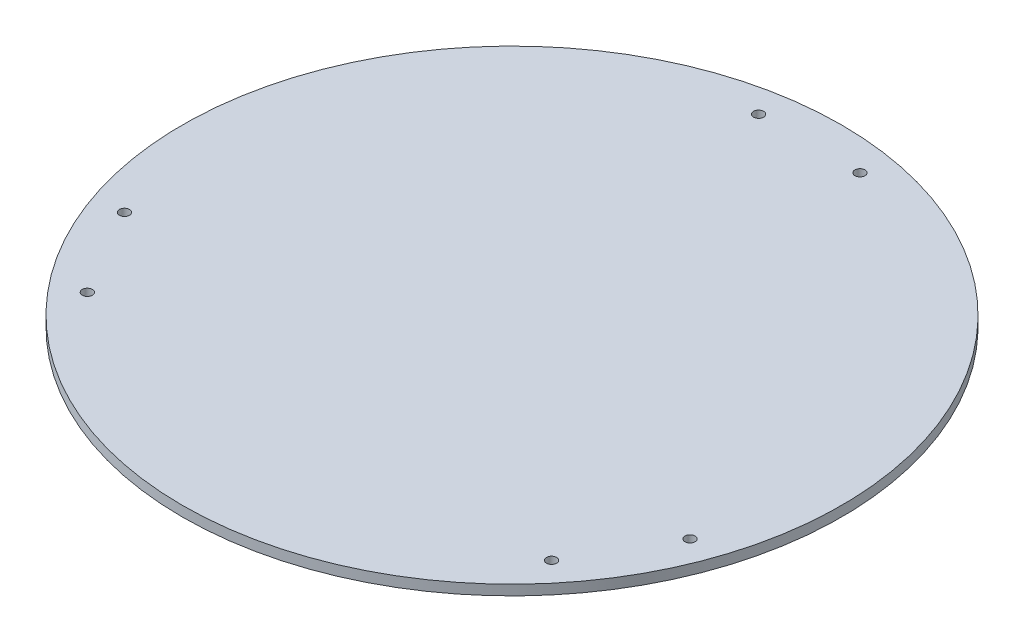
ISO-10303-21;
HEADER;
FILE_DESCRIPTION(('STEP AP214'),'2;1');
FILE_NAME('part.step','',(''),(''),'','','');
FILE_SCHEMA(('AUTOMOTIVE_DESIGN { 1 0 10303 214 1 1 1 1 }'));
ENDSEC;
DATA;
#1=APPLICATION_CONTEXT('core data for automotive mechanical design processes');
#2=APPLICATION_PROTOCOL_DEFINITION('international standard','automotive_design',2000,#1);
#3=PRODUCT_CONTEXT('',#1,'mechanical');
#4=PRODUCT('Part','Part','',(#3));
#5=PRODUCT_RELATED_PRODUCT_CATEGORY('part','',(#4));
#6=PRODUCT_DEFINITION_FORMATION('','',#4);
#7=PRODUCT_DEFINITION_CONTEXT('part definition',#1,'design');
#8=PRODUCT_DEFINITION('design','',#6,#7);
#9=PRODUCT_DEFINITION_SHAPE('','',#8);
#10=(LENGTH_UNIT() NAMED_UNIT(*) SI_UNIT(.MILLI.,.METRE.));
#11=(NAMED_UNIT(*) PLANE_ANGLE_UNIT() SI_UNIT($,.RADIAN.));
#12=(NAMED_UNIT(*) SI_UNIT($,.STERADIAN.) SOLID_ANGLE_UNIT());
#13=UNCERTAINTY_MEASURE_WITH_UNIT(LENGTH_MEASURE(1.E-05),#10,'distance_accuracy_value','');
#14=(GEOMETRIC_REPRESENTATION_CONTEXT(3) GLOBAL_UNCERTAINTY_ASSIGNED_CONTEXT((#13)) GLOBAL_UNIT_ASSIGNED_CONTEXT((#10,
#11,#12)) REPRESENTATION_CONTEXT('',''));
#15=CARTESIAN_POINT('',(0.,0.,0.));
#16=DIRECTION('',(0.,0.,1.));
#17=DIRECTION('',(1.,0.,0.));
#18=AXIS2_PLACEMENT_3D('',#15,#16,#17);
#19=CARTESIAN_POINT('',(0.,2.,0.));
#20=DIRECTION('',(0.,1.,0.));
#21=DIRECTION('',(0.,0.,1.));
#22=AXIS2_PLACEMENT_3D('',#19,#20,#21);
#23=PLANE('',#22);
#24=CARTESIAN_POINT('',(-45.7779755405675,2.,37.9769318851096));
#25=DIRECTION('',(0.,1.,0.));
#26=DIRECTION('',(0.,0.,1.));
#27=AXIS2_PLACEMENT_3D('',#24,#25,#26);
#28=CIRCLE('',#27,1.00000000001543);
#29=CARTESIAN_POINT('',(-45.7779755405675,2.,38.976931885125));
#30=VERTEX_POINT('',#29);
#31=EDGE_CURVE('E65',#30,#30,#28,.T.);
#32=ORIENTED_EDGE('',*,*,#31,.F.);
#33=EDGE_LOOP('',(#32));
#34=FACE_BOUND('',#33,.T.);
#35=CARTESIAN_POINT('',(55.777975540595,2.,20.6564238094049));
#36=DIRECTION('',(0.,1.,0.));
#37=DIRECTION('',(0.,0.,1.));
#38=AXIS2_PLACEMENT_3D('',#35,#36,#37);
#39=CIRCLE('',#38,1.00000000001305);
#40=CARTESIAN_POINT('',(55.777975540595,2.,21.656423809418));
#41=VERTEX_POINT('',#40);
#42=EDGE_CURVE('E53',#41,#41,#39,.T.);
#43=ORIENTED_EDGE('',*,*,#42,.F.);
#44=EDGE_LOOP('',(#43));
#45=FACE_BOUND('',#44,.T.);
#46=CARTESIAN_POINT('',(-10.,2.,-58.6333556945191));
#47=DIRECTION('',(0.,1.,0.));
#48=DIRECTION('',(0.,0.,1.));
#49=AXIS2_PLACEMENT_3D('',#46,#47,#48);
#50=CIRCLE('',#49,1.);
#51=CARTESIAN_POINT('',(-10.,2.,-57.6333556945191));
#52=VERTEX_POINT('',#51);
#53=EDGE_CURVE('E42',#52,#52,#50,.T.);
#54=ORIENTED_EDGE('',*,*,#53,.F.);
#55=EDGE_LOOP('',(#54));
#56=FACE_BOUND('',#55,.T.);
#57=CARTESIAN_POINT('',(0.,2.,0.));
#58=DIRECTION('',(0.,1.,0.));
#59=DIRECTION('',(0.,0.,1.));
#60=AXIS2_PLACEMENT_3D('',#57,#58,#59);
#61=CIRCLE('',#60,65.);
#62=CARTESIAN_POINT('',(0.,2.,65.));
#63=VERTEX_POINT('',#62);
#64=EDGE_CURVE('E10',#63,#63,#61,.T.);
#65=ORIENTED_EDGE('',*,*,#64,.T.);
#66=EDGE_LOOP('',(#65));
#67=FACE_BOUND('',#66,.T.);
#68=CARTESIAN_POINT('',(10.,2.,-58.6333556945191));
#69=DIRECTION('',(0.,1.,0.));
#70=DIRECTION('',(0.,0.,-1.));
#71=AXIS2_PLACEMENT_3D('',#68,#69,#70);
#72=CIRCLE('',#71,1.);
#73=CARTESIAN_POINT('',(10.,2.,-59.6333556945191));
#74=VERTEX_POINT('',#73);
#75=EDGE_CURVE('E47',#74,#74,#72,.T.);
#76=ORIENTED_EDGE('',*,*,#75,.F.);
#77=EDGE_LOOP('',(#76));
#78=FACE_BOUND('',#77,.T.);
#79=CARTESIAN_POINT('',(45.777975540595,2.,37.9769318850937));
#80=DIRECTION('',(0.,1.,0.));
#81=DIRECTION('',(0.,0.,-1.));
#82=AXIS2_PLACEMENT_3D('',#79,#80,#81);
#83=CIRCLE('',#82,0.999999999983656);
#84=CARTESIAN_POINT('',(45.777975540595,2.,36.9769318851101));
#85=VERTEX_POINT('',#84);
#86=EDGE_CURVE('E59',#85,#85,#83,.T.);
#87=ORIENTED_EDGE('',*,*,#86,.F.);
#88=EDGE_LOOP('',(#87));
#89=FACE_BOUND('',#88,.T.);
#90=CARTESIAN_POINT('',(-55.7779755405675,2.,20.6564238094208));
#91=DIRECTION('',(0.,1.,0.));
#92=DIRECTION('',(0.,0.,-1.));
#93=AXIS2_PLACEMENT_3D('',#90,#91,#92);
#94=CIRCLE('',#93,0.999999999990548);
#95=CARTESIAN_POINT('',(-55.7779755405675,2.,19.6564238094303));
#96=VERTEX_POINT('',#95);
#97=EDGE_CURVE('E71',#96,#96,#94,.T.);
#98=ORIENTED_EDGE('',*,*,#97,.F.);
#99=EDGE_LOOP('',(#98));
#100=FACE_BOUND('',#99,.T.);
#101=ADVANCED_FACE('F31',(#34,#45,#56,#67,#78,#89,#100),#23,.T.);
#102=CARTESIAN_POINT('',(0.,0.,0.));
#103=DIRECTION('',(0.,1.,0.));
#104=DIRECTION('',(0.,0.,1.));
#105=AXIS2_PLACEMENT_3D('',#102,#103,#104);
#106=PLANE('',#105);
#107=CARTESIAN_POINT('',(0.,0.,0.));
#108=DIRECTION('',(0.,1.,0.));
#109=DIRECTION('',(0.,0.,1.));
#110=AXIS2_PLACEMENT_3D('',#107,#108,#109);
#111=CIRCLE('',#110,65.);
#112=CARTESIAN_POINT('',(0.,0.,65.));
#113=VERTEX_POINT('',#112);
#114=EDGE_CURVE('E35',#113,#113,#111,.T.);
#115=ORIENTED_EDGE('',*,*,#114,.F.);
#116=EDGE_LOOP('',(#115));
#117=FACE_BOUND('',#116,.T.);
#118=CARTESIAN_POINT('',(-10.,0.,-58.6333556945191));
#119=DIRECTION('',(0.,1.,0.));
#120=DIRECTION('',(0.,0.,1.));
#121=AXIS2_PLACEMENT_3D('',#118,#119,#120);
#122=CIRCLE('',#121,1.);
#123=CARTESIAN_POINT('',(-10.,0.,-57.6333556945191));
#124=VERTEX_POINT('',#123);
#125=EDGE_CURVE('E44',#124,#124,#122,.T.);
#126=ORIENTED_EDGE('',*,*,#125,.T.);
#127=EDGE_LOOP('',(#126));
#128=FACE_BOUND('',#127,.T.);
#129=CARTESIAN_POINT('',(10.,0.,-58.6333556945191));
#130=DIRECTION('',(0.,1.,0.));
#131=DIRECTION('',(0.,0.,-1.));
#132=AXIS2_PLACEMENT_3D('',#129,#130,#131);
#133=CIRCLE('',#132,1.);
#134=CARTESIAN_POINT('',(10.,0.,-59.6333556945191));
#135=VERTEX_POINT('',#134);
#136=EDGE_CURVE('E50',#135,#135,#133,.T.);
#137=ORIENTED_EDGE('',*,*,#136,.T.);
#138=EDGE_LOOP('',(#137));
#139=FACE_BOUND('',#138,.T.);
#140=CARTESIAN_POINT('',(55.777975540595,0.,20.6564238094049));
#141=DIRECTION('',(0.,1.,0.));
#142=DIRECTION('',(0.,0.,1.));
#143=AXIS2_PLACEMENT_3D('',#140,#141,#142);
#144=CIRCLE('',#143,1.00000000001305);
#145=CARTESIAN_POINT('',(55.777975540595,0.,21.656423809418));
#146=VERTEX_POINT('',#145);
#147=EDGE_CURVE('E56',#146,#146,#144,.T.);
#148=ORIENTED_EDGE('',*,*,#147,.T.);
#149=EDGE_LOOP('',(#148));
#150=FACE_BOUND('',#149,.T.);
#151=CARTESIAN_POINT('',(45.777975540595,0.,37.9769318850937));
#152=DIRECTION('',(0.,1.,0.));
#153=DIRECTION('',(0.,0.,-1.));
#154=AXIS2_PLACEMENT_3D('',#151,#152,#153);
#155=CIRCLE('',#154,0.999999999983656);
#156=CARTESIAN_POINT('',(45.777975540595,0.,36.9769318851101));
#157=VERTEX_POINT('',#156);
#158=EDGE_CURVE('E62',#157,#157,#155,.T.);
#159=ORIENTED_EDGE('',*,*,#158,.T.);
#160=EDGE_LOOP('',(#159));
#161=FACE_BOUND('',#160,.T.);
#162=CARTESIAN_POINT('',(-45.7779755405675,0.,37.9769318851096));
#163=DIRECTION('',(0.,1.,0.));
#164=DIRECTION('',(0.,0.,1.));
#165=AXIS2_PLACEMENT_3D('',#162,#163,#164);
#166=CIRCLE('',#165,1.00000000001543);
#167=CARTESIAN_POINT('',(-45.7779755405675,0.,38.976931885125));
#168=VERTEX_POINT('',#167);
#169=EDGE_CURVE('E68',#168,#168,#166,.T.);
#170=ORIENTED_EDGE('',*,*,#169,.T.);
#171=EDGE_LOOP('',(#170));
#172=FACE_BOUND('',#171,.T.);
#173=CARTESIAN_POINT('',(-55.7779755405675,0.,20.6564238094208));
#174=DIRECTION('',(0.,1.,0.));
#175=DIRECTION('',(0.,0.,-1.));
#176=AXIS2_PLACEMENT_3D('',#173,#174,#175);
#177=CIRCLE('',#176,0.999999999990548);
#178=CARTESIAN_POINT('',(-55.7779755405675,0.,19.6564238094303));
#179=VERTEX_POINT('',#178);
#180=EDGE_CURVE('E74',#179,#179,#177,.T.);
#181=ORIENTED_EDGE('',*,*,#180,.T.);
#182=EDGE_LOOP('',(#181));
#183=FACE_BOUND('',#182,.T.);
#184=ADVANCED_FACE('F84',(#117,#128,#139,#150,#161,#172,#183),#106,.F.);
#185=CARTESIAN_POINT('',(0.,2.,0.));
#186=DIRECTION('',(0.,-1.,0.));
#187=DIRECTION('',(0.,0.,-1.));
#188=AXIS2_PLACEMENT_3D('',#185,#186,#187);
#189=CYLINDRICAL_SURFACE('',#188,65.);
#190=ORIENTED_EDGE('',*,*,#64,.F.);
#191=EDGE_LOOP('',(#190));
#192=FACE_BOUND('',#191,.T.);
#193=ORIENTED_EDGE('',*,*,#114,.T.);
#194=EDGE_LOOP('',(#193));
#195=FACE_BOUND('',#194,.T.);
#196=ADVANCED_FACE('F33',(#192,#195),#189,.T.);
#197=CARTESIAN_POINT('',(-10.,2.,-58.6333556945191));
#198=DIRECTION('',(0.,-1.,0.));
#199=DIRECTION('',(0.,0.,-1.));
#200=AXIS2_PLACEMENT_3D('',#197,#198,#199);
#201=CYLINDRICAL_SURFACE('',#200,1.);
#202=ORIENTED_EDGE('',*,*,#53,.T.);
#203=EDGE_LOOP('',(#202));
#204=FACE_BOUND('',#203,.T.);
#205=ORIENTED_EDGE('',*,*,#125,.F.);
#206=EDGE_LOOP('',(#205));
#207=FACE_BOUND('',#206,.T.);
#208=ADVANCED_FACE('F94',(#204,#207),#201,.F.);
#209=CARTESIAN_POINT('',(10.,2.,-58.6333556945191));
#210=DIRECTION('',(0.,-1.,0.));
#211=DIRECTION('',(0.,0.,-1.));
#212=AXIS2_PLACEMENT_3D('',#209,#210,#211);
#213=CYLINDRICAL_SURFACE('',#212,1.);
#214=ORIENTED_EDGE('',*,*,#75,.T.);
#215=EDGE_LOOP('',(#214));
#216=FACE_BOUND('',#215,.T.);
#217=ORIENTED_EDGE('',*,*,#136,.F.);
#218=EDGE_LOOP('',(#217));
#219=FACE_BOUND('',#218,.T.);
#220=ADVANCED_FACE('F97',(#216,#219),#213,.F.);
#221=CARTESIAN_POINT('',(55.777975540595,2.,20.6564238094049));
#222=DIRECTION('',(0.,-1.,0.));
#223=DIRECTION('',(0.,0.,-1.));
#224=AXIS2_PLACEMENT_3D('',#221,#222,#223);
#225=CYLINDRICAL_SURFACE('',#224,1.00000000001305);
#226=ORIENTED_EDGE('',*,*,#42,.T.);
#227=EDGE_LOOP('',(#226));
#228=FACE_BOUND('',#227,.T.);
#229=ORIENTED_EDGE('',*,*,#147,.F.);
#230=EDGE_LOOP('',(#229));
#231=FACE_BOUND('',#230,.T.);
#232=ADVANCED_FACE('F101',(#228,#231),#225,.F.);
#233=CARTESIAN_POINT('',(45.777975540595,2.,37.9769318850937));
#234=DIRECTION('',(0.,-1.,0.));
#235=DIRECTION('',(0.,0.,-1.));
#236=AXIS2_PLACEMENT_3D('',#233,#234,#235);
#237=CYLINDRICAL_SURFACE('',#236,0.999999999983656);
#238=ORIENTED_EDGE('',*,*,#86,.T.);
#239=EDGE_LOOP('',(#238));
#240=FACE_BOUND('',#239,.T.);
#241=ORIENTED_EDGE('',*,*,#158,.F.);
#242=EDGE_LOOP('',(#241));
#243=FACE_BOUND('',#242,.T.);
#244=ADVANCED_FACE('F105',(#240,#243),#237,.F.);
#245=CARTESIAN_POINT('',(-45.7779755405675,2.,37.9769318851096));
#246=DIRECTION('',(0.,-1.,0.));
#247=DIRECTION('',(0.,0.,-1.));
#248=AXIS2_PLACEMENT_3D('',#245,#246,#247);
#249=CYLINDRICAL_SURFACE('',#248,1.00000000001543);
#250=ORIENTED_EDGE('',*,*,#31,.T.);
#251=EDGE_LOOP('',(#250));
#252=FACE_BOUND('',#251,.T.);
#253=ORIENTED_EDGE('',*,*,#169,.F.);
#254=EDGE_LOOP('',(#253));
#255=FACE_BOUND('',#254,.T.);
#256=ADVANCED_FACE('F109',(#252,#255),#249,.F.);
#257=CARTESIAN_POINT('',(-55.7779755405675,2.,20.6564238094208));
#258=DIRECTION('',(0.,-1.,0.));
#259=DIRECTION('',(0.,0.,-1.));
#260=AXIS2_PLACEMENT_3D('',#257,#258,#259);
#261=CYLINDRICAL_SURFACE('',#260,0.999999999990548);
#262=ORIENTED_EDGE('',*,*,#97,.T.);
#263=EDGE_LOOP('',(#262));
#264=FACE_BOUND('',#263,.T.);
#265=ORIENTED_EDGE('',*,*,#180,.F.);
#266=EDGE_LOOP('',(#265));
#267=FACE_BOUND('',#266,.T.);
#268=ADVANCED_FACE('F80',(#264,#267),#261,.F.);
#269=CLOSED_SHELL('',(#101,#184,#196,#208,#220,#232,#244,#256,#268));
#270=MANIFOLD_SOLID_BREP('B2',#269);
#271=ADVANCED_BREP_SHAPE_REPRESENTATION('',(#18,#270),#14);
#272=SHAPE_DEFINITION_REPRESENTATION(#9,#271);
ENDSEC;
END-ISO-10303-21;
